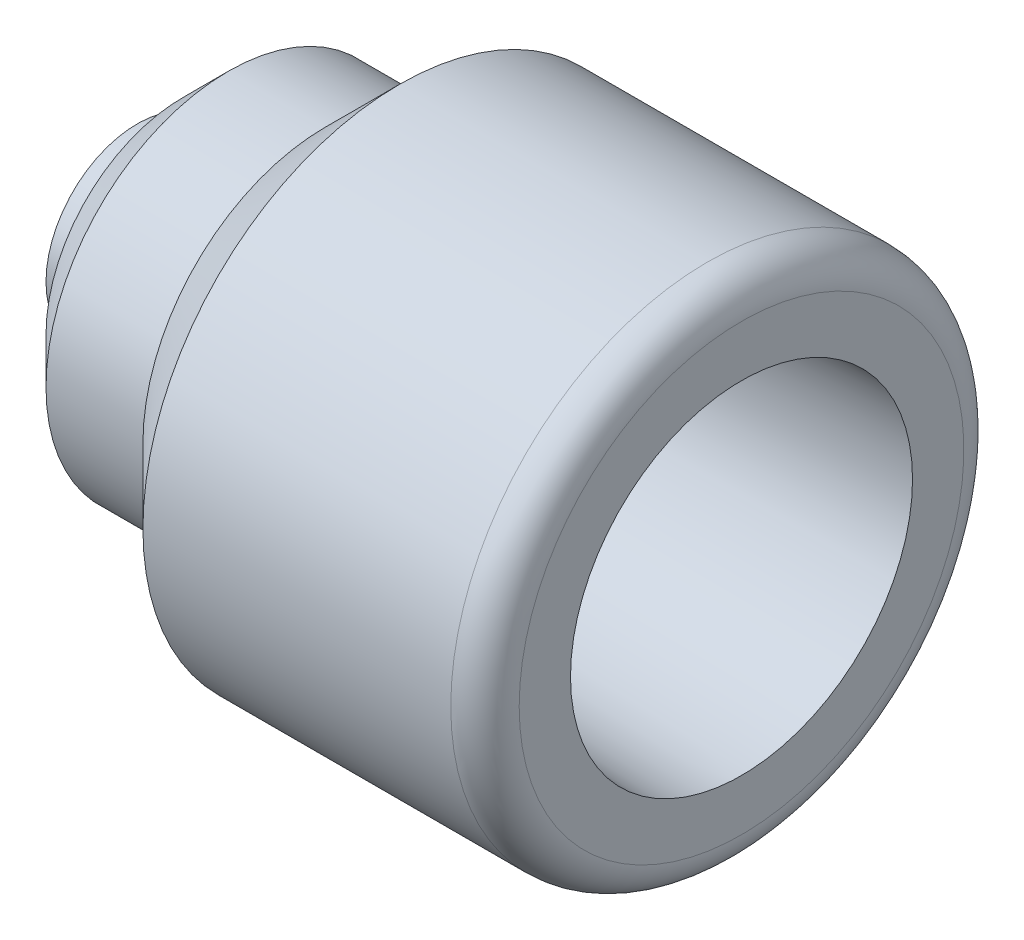
ISO-10303-21;
HEADER;
FILE_DESCRIPTION(('STEP AP214'),'2;1');
FILE_NAME('part.step','',(''),(''),'','','');
FILE_SCHEMA(('AUTOMOTIVE_DESIGN { 1 0 10303 214 1 1 1 1 }'));
ENDSEC;
DATA;
#1=APPLICATION_CONTEXT('core data for automotive mechanical design processes');
#2=APPLICATION_PROTOCOL_DEFINITION('international standard','automotive_design',2000,#1);
#3=PRODUCT_CONTEXT('',#1,'mechanical');
#4=PRODUCT('Part','Part','',(#3));
#5=PRODUCT_RELATED_PRODUCT_CATEGORY('part','',(#4));
#6=PRODUCT_DEFINITION_FORMATION('','',#4);
#7=PRODUCT_DEFINITION_CONTEXT('part definition',#1,'design');
#8=PRODUCT_DEFINITION('design','',#6,#7);
#9=PRODUCT_DEFINITION_SHAPE('','',#8);
#10=(LENGTH_UNIT() NAMED_UNIT(*) SI_UNIT(.MILLI.,.METRE.));
#11=(NAMED_UNIT(*) PLANE_ANGLE_UNIT() SI_UNIT($,.RADIAN.));
#12=(NAMED_UNIT(*) SI_UNIT($,.STERADIAN.) SOLID_ANGLE_UNIT());
#13=UNCERTAINTY_MEASURE_WITH_UNIT(LENGTH_MEASURE(1.E-05),#10,'distance_accuracy_value','');
#14=(GEOMETRIC_REPRESENTATION_CONTEXT(3) GLOBAL_UNCERTAINTY_ASSIGNED_CONTEXT((#13)) GLOBAL_UNIT_ASSIGNED_CONTEXT((#10,
#11,#12)) REPRESENTATION_CONTEXT('',''));
#15=CARTESIAN_POINT('',(0.,0.,0.));
#16=DIRECTION('',(0.,0.,1.));
#17=DIRECTION('',(1.,0.,0.));
#18=AXIS2_PLACEMENT_3D('',#15,#16,#17);
#19=CARTESIAN_POINT('',(8.,0.,0.));
#20=DIRECTION('',(1.,0.,0.));
#21=DIRECTION('',(0.,0.,-1.));
#22=AXIS2_PLACEMENT_3D('',#19,#20,#21);
#23=CONICAL_SURFACE('',#22,16.,0.78539816339745);
#24=CARTESIAN_POINT('',(4.,0.,0.));
#25=DIRECTION('',(-1.,0.,0.));
#26=DIRECTION('',(0.,0.,1.));
#27=AXIS2_PLACEMENT_3D('',#24,#25,#26);
#28=CIRCLE('',#27,12.);
#29=CARTESIAN_POINT('',(4.,0.,12.));
#30=VERTEX_POINT('',#29);
#31=EDGE_CURVE('E86',#30,#30,#28,.T.);
#32=ORIENTED_EDGE('',*,*,#31,.F.);
#33=EDGE_LOOP('',(#32));
#34=FACE_BOUND('',#33,.T.);
#35=CARTESIAN_POINT('',(8.,0.,0.));
#36=DIRECTION('',(-1.,0.,0.));
#37=DIRECTION('',(0.,0.,1.));
#38=AXIS2_PLACEMENT_3D('',#35,#36,#37);
#39=CIRCLE('',#38,16.);
#40=CARTESIAN_POINT('',(8.,0.,16.));
#41=VERTEX_POINT('',#40);
#42=EDGE_CURVE('E10',#41,#41,#39,.T.);
#43=ORIENTED_EDGE('',*,*,#42,.T.);
#44=EDGE_LOOP('',(#43));
#45=FACE_BOUND('',#44,.T.);
#46=ADVANCED_FACE('F43',(#34,#45),#23,.T.);
#47=CARTESIAN_POINT('',(0.,0.,0.));
#48=DIRECTION('',(-1.,0.,0.));
#49=DIRECTION('',(0.,0.,1.));
#50=AXIS2_PLACEMENT_3D('',#47,#48,#49);
#51=CYLINDRICAL_SURFACE('',#50,16.);
#52=ORIENTED_EDGE('',*,*,#42,.F.);
#53=EDGE_LOOP('',(#52));
#54=FACE_BOUND('',#53,.T.);
#55=CARTESIAN_POINT('',(16.4999999999999,0.,0.));
#56=DIRECTION('',(-1.,0.,0.));
#57=DIRECTION('',(0.,0.,1.));
#58=AXIS2_PLACEMENT_3D('',#55,#56,#57);
#59=CIRCLE('',#58,16.);
#60=CARTESIAN_POINT('',(16.4999999999999,0.,16.));
#61=VERTEX_POINT('',#60);
#62=EDGE_CURVE('E49',#61,#61,#59,.T.);
#63=ORIENTED_EDGE('',*,*,#62,.T.);
#64=EDGE_LOOP('',(#63));
#65=FACE_BOUND('',#64,.T.);
#66=ADVANCED_FACE('F93',(#54,#65),#51,.T.);
#67=CARTESIAN_POINT('',(23.,0.,0.));
#68=DIRECTION('',(1.,0.,0.));
#69=DIRECTION('',(0.,0.,-1.));
#70=AXIS2_PLACEMENT_3D('',#67,#68,#69);
#71=CONICAL_SURFACE('',#70,22.5,0.785398163397443);
#72=ORIENTED_EDGE('',*,*,#62,.F.);
#73=EDGE_LOOP('',(#72));
#74=FACE_BOUND('',#73,.T.);
#75=CARTESIAN_POINT('',(23.,0.,0.));
#76=DIRECTION('',(-1.,0.,0.));
#77=DIRECTION('',(0.,0.,1.));
#78=AXIS2_PLACEMENT_3D('',#75,#76,#77);
#79=CIRCLE('',#78,22.5);
#80=CARTESIAN_POINT('',(23.,0.,22.5));
#81=VERTEX_POINT('',#80);
#82=EDGE_CURVE('E53',#81,#81,#79,.T.);
#83=ORIENTED_EDGE('',*,*,#82,.T.);
#84=EDGE_LOOP('',(#83));
#85=FACE_BOUND('',#84,.T.);
#86=ADVANCED_FACE('F97',(#74,#85),#71,.T.);
#87=CARTESIAN_POINT('',(0.,0.,0.));
#88=DIRECTION('',(-1.,0.,0.));
#89=DIRECTION('',(0.,0.,1.));
#90=AXIS2_PLACEMENT_3D('',#87,#88,#89);
#91=CYLINDRICAL_SURFACE('',#90,22.5);
#92=ORIENTED_EDGE('',*,*,#82,.F.);
#93=EDGE_LOOP('',(#92));
#94=FACE_BOUND('',#93,.T.);
#95=CARTESIAN_POINT('',(50.,0.,0.));
#96=DIRECTION('',(-1.,0.,0.));
#97=DIRECTION('',(0.,0.,1.));
#98=AXIS2_PLACEMENT_3D('',#95,#96,#97);
#99=CIRCLE('',#98,22.5);
#100=CARTESIAN_POINT('',(50.,0.,22.5));
#101=VERTEX_POINT('',#100);
#102=EDGE_CURVE('E57',#101,#101,#99,.T.);
#103=ORIENTED_EDGE('',*,*,#102,.T.);
#104=EDGE_LOOP('',(#103));
#105=FACE_BOUND('',#104,.T.);
#106=ADVANCED_FACE('F102',(#94,#105),#91,.T.);
#107=CARTESIAN_POINT('',(50.,0.,0.));
#108=DIRECTION('',(-1.,0.,0.));
#109=DIRECTION('',(0.,0.,1.));
#110=AXIS2_PLACEMENT_3D('',#107,#108,#109);
#111=TOROIDAL_SURFACE('',#110,19.5,3.);
#112=ORIENTED_EDGE('',*,*,#102,.F.);
#113=EDGE_LOOP('',(#112));
#114=FACE_BOUND('',#113,.T.);
#115=CARTESIAN_POINT('',(53.,0.,0.));
#116=DIRECTION('',(-1.,0.,0.));
#117=DIRECTION('',(0.,0.,1.));
#118=AXIS2_PLACEMENT_3D('',#115,#116,#117);
#119=CIRCLE('',#118,19.5);
#120=CARTESIAN_POINT('',(53.,0.,19.5));
#121=VERTEX_POINT('',#120);
#122=EDGE_CURVE('E62',#121,#121,#119,.T.);
#123=ORIENTED_EDGE('',*,*,#122,.T.);
#124=EDGE_LOOP('',(#123));
#125=FACE_BOUND('',#124,.T.);
#126=ADVANCED_FACE('F108',(#114,#125),#111,.T.);
#127=CARTESIAN_POINT('',(53.,15.,0.));
#128=DIRECTION('',(-1.,0.,0.));
#129=DIRECTION('',(0.,0.,1.));
#130=AXIS2_PLACEMENT_3D('',#127,#128,#129);
#131=PLANE('',#130);
#132=ORIENTED_EDGE('',*,*,#122,.F.);
#133=EDGE_LOOP('',(#132));
#134=FACE_BOUND('',#133,.T.);
#135=CARTESIAN_POINT('',(53.,0.,0.));
#136=DIRECTION('',(-1.,0.,0.));
#137=DIRECTION('',(0.,0.,1.));
#138=AXIS2_PLACEMENT_3D('',#135,#136,#137);
#139=CIRCLE('',#138,15.);
#140=CARTESIAN_POINT('',(53.,0.,15.));
#141=VERTEX_POINT('',#140);
#142=EDGE_CURVE('E65',#141,#141,#139,.T.);
#143=ORIENTED_EDGE('',*,*,#142,.T.);
#144=EDGE_LOOP('',(#143));
#145=FACE_BOUND('',#144,.T.);
#146=ADVANCED_FACE('F112',(#134,#145),#131,.F.);
#147=CARTESIAN_POINT('',(25.772080402638,0.,0.));
#148=DIRECTION('',(1.,0.,0.));
#149=DIRECTION('',(0.,0.,-1.));
#150=AXIS2_PLACEMENT_3D('',#147,#148,#149);
#151=CONICAL_SURFACE('',#150,14.0491800960007,0.0349065850398874);
#152=ORIENTED_EDGE('',*,*,#142,.F.);
#153=EDGE_LOOP('',(#152));
#154=FACE_BOUND('',#153,.T.);
#155=CARTESIAN_POINT('',(25.772080402638,0.,0.));
#156=DIRECTION('',(-1.,0.,0.));
#157=DIRECTION('',(0.,0.,1.));
#158=AXIS2_PLACEMENT_3D('',#155,#156,#157);
#159=CIRCLE('',#158,14.0491800960007);
#160=CARTESIAN_POINT('',(25.772080402638,0.,14.0491800960007));
#161=VERTEX_POINT('',#160);
#162=EDGE_CURVE('E68',#161,#161,#159,.T.);
#163=ORIENTED_EDGE('',*,*,#162,.T.);
#164=EDGE_LOOP('',(#163));
#165=FACE_BOUND('',#164,.T.);
#166=ADVANCED_FACE('F116',(#154,#165),#151,.F.);
#167=CARTESIAN_POINT('',(25.8,0.,0.));
#168=DIRECTION('',(-1.,0.,0.));
#169=DIRECTION('',(0.,0.,1.));
#170=AXIS2_PLACEMENT_3D('',#167,#168,#169);
#171=TOROIDAL_SURFACE('',#170,13.2496674343854,0.799999999999999);
#172=ORIENTED_EDGE('',*,*,#162,.F.);
#173=EDGE_LOOP('',(#172));
#174=FACE_BOUND('',#173,.T.);
#175=CARTESIAN_POINT('',(25.,0.,0.));
#176=DIRECTION('',(-1.,0.,0.));
#177=DIRECTION('',(0.,0.,1.));
#178=AXIS2_PLACEMENT_3D('',#175,#176,#177);
#179=CIRCLE('',#178,13.2496674343854);
#180=CARTESIAN_POINT('',(25.,0.,13.2496674343854));
#181=VERTEX_POINT('',#180);
#182=EDGE_CURVE('E71',#181,#181,#179,.T.);
#183=ORIENTED_EDGE('',*,*,#182,.T.);
#184=EDGE_LOOP('',(#183));
#185=FACE_BOUND('',#184,.T.);
#186=ADVANCED_FACE('F120',(#174,#185),#171,.F.);
#187=CARTESIAN_POINT('',(25.,13.2496674343854,0.));
#188=DIRECTION('',(-1.,0.,0.));
#189=DIRECTION('',(0.,0.,1.));
#190=AXIS2_PLACEMENT_3D('',#187,#188,#189);
#191=PLANE('',#190);
#192=ORIENTED_EDGE('',*,*,#182,.F.);
#193=EDGE_LOOP('',(#192));
#194=FACE_BOUND('',#193,.T.);
#195=CARTESIAN_POINT('',(25.,0.,0.));
#196=DIRECTION('',(-1.,0.,0.));
#197=DIRECTION('',(0.,0.,1.));
#198=AXIS2_PLACEMENT_3D('',#195,#196,#197);
#199=CIRCLE('',#198,5.1);
#200=CARTESIAN_POINT('',(25.,0.,5.1));
#201=VERTEX_POINT('',#200);
#202=EDGE_CURVE('E74',#201,#201,#199,.T.);
#203=ORIENTED_EDGE('',*,*,#202,.T.);
#204=EDGE_LOOP('',(#203));
#205=FACE_BOUND('',#204,.T.);
#206=ADVANCED_FACE('F124',(#194,#205),#191,.F.);
#207=CARTESIAN_POINT('',(0.,0.,0.));
#208=DIRECTION('',(-1.,0.,0.));
#209=DIRECTION('',(0.,0.,1.));
#210=AXIS2_PLACEMENT_3D('',#207,#208,#209);
#211=CYLINDRICAL_SURFACE('',#210,5.1);
#212=ORIENTED_EDGE('',*,*,#202,.F.);
#213=EDGE_LOOP('',(#212));
#214=FACE_BOUND('',#213,.T.);
#215=CARTESIAN_POINT('',(0.,0.,0.));
#216=DIRECTION('',(-1.,0.,0.));
#217=DIRECTION('',(0.,0.,1.));
#218=AXIS2_PLACEMENT_3D('',#215,#216,#217);
#219=CIRCLE('',#218,5.1);
#220=CARTESIAN_POINT('',(0.,0.,5.1));
#221=VERTEX_POINT('',#220);
#222=EDGE_CURVE('E77',#221,#221,#219,.T.);
#223=ORIENTED_EDGE('',*,*,#222,.T.);
#224=EDGE_LOOP('',(#223));
#225=FACE_BOUND('',#224,.T.);
#226=ADVANCED_FACE('F128',(#214,#225),#211,.F.);
#227=CARTESIAN_POINT('',(0.,8.,0.));
#228=DIRECTION('',(1.,0.,0.));
#229=DIRECTION('',(0.,0.,-1.));
#230=AXIS2_PLACEMENT_3D('',#227,#228,#229);
#231=PLANE('',#230);
#232=ORIENTED_EDGE('',*,*,#222,.F.);
#233=EDGE_LOOP('',(#232));
#234=FACE_BOUND('',#233,.T.);
#235=CARTESIAN_POINT('',(0.,0.,0.));
#236=DIRECTION('',(-1.,0.,0.));
#237=DIRECTION('',(0.,0.,1.));
#238=AXIS2_PLACEMENT_3D('',#235,#236,#237);
#239=CIRCLE('',#238,8.);
#240=CARTESIAN_POINT('',(0.,0.,8.));
#241=VERTEX_POINT('',#240);
#242=EDGE_CURVE('E80',#241,#241,#239,.T.);
#243=ORIENTED_EDGE('',*,*,#242,.T.);
#244=EDGE_LOOP('',(#243));
#245=FACE_BOUND('',#244,.T.);
#246=ADVANCED_FACE('F132',(#234,#245),#231,.F.);
#247=CARTESIAN_POINT('',(0.,0.,0.));
#248=DIRECTION('',(-1.,0.,0.));
#249=DIRECTION('',(0.,0.,1.));
#250=AXIS2_PLACEMENT_3D('',#247,#248,#249);
#251=CYLINDRICAL_SURFACE('',#250,8.);
#252=ORIENTED_EDGE('',*,*,#242,.F.);
#253=EDGE_LOOP('',(#252));
#254=FACE_BOUND('',#253,.T.);
#255=CARTESIAN_POINT('',(4.,0.,0.));
#256=DIRECTION('',(-1.,0.,0.));
#257=DIRECTION('',(0.,0.,1.));
#258=AXIS2_PLACEMENT_3D('',#255,#256,#257);
#259=CIRCLE('',#258,8.);
#260=CARTESIAN_POINT('',(4.,0.,8.));
#261=VERTEX_POINT('',#260);
#262=EDGE_CURVE('E83',#261,#261,#259,.T.);
#263=ORIENTED_EDGE('',*,*,#262,.T.);
#264=EDGE_LOOP('',(#263));
#265=FACE_BOUND('',#264,.T.);
#266=ADVANCED_FACE('F136',(#254,#265),#251,.T.);
#267=CARTESIAN_POINT('',(4.,8.,0.));
#268=DIRECTION('',(1.,0.,0.));
#269=DIRECTION('',(0.,0.,-1.));
#270=AXIS2_PLACEMENT_3D('',#267,#268,#269);
#271=PLANE('',#270);
#272=ORIENTED_EDGE('',*,*,#262,.F.);
#273=EDGE_LOOP('',(#272));
#274=FACE_BOUND('',#273,.T.);
#275=ORIENTED_EDGE('',*,*,#31,.T.);
#276=EDGE_LOOP('',(#275));
#277=FACE_BOUND('',#276,.T.);
#278=ADVANCED_FACE('F90',(#274,#277),#271,.F.);
#279=CLOSED_SHELL('',(#46,#66,#86,#106,#126,#146,#166,#186,#206,#226,#246,#266,#278));
#280=MANIFOLD_SOLID_BREP('B2',#279);
#281=ADVANCED_BREP_SHAPE_REPRESENTATION('',(#18,#280),#14);
#282=SHAPE_DEFINITION_REPRESENTATION(#9,#281);
ENDSEC;
END-ISO-10303-21;
